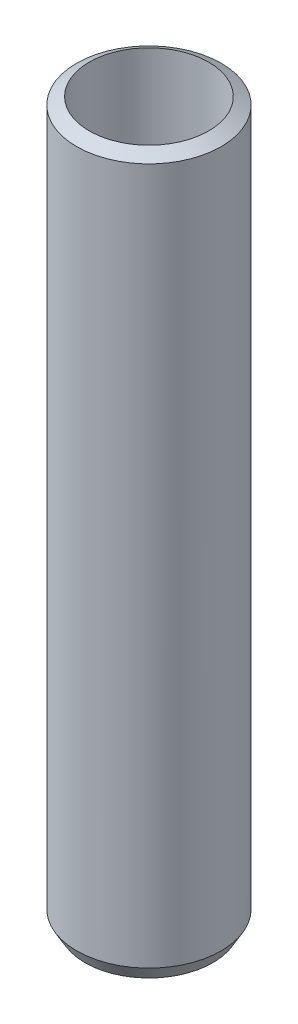
ISO-10303-21;
HEADER;
FILE_DESCRIPTION(('STEP AP214'),'2;1');
FILE_NAME('part.step','',(''),(''),'','','');
FILE_SCHEMA(('AUTOMOTIVE_DESIGN { 1 0 10303 214 1 1 1 1 }'));
ENDSEC;
DATA;
#1=APPLICATION_CONTEXT('core data for automotive mechanical design processes');
#2=APPLICATION_PROTOCOL_DEFINITION('international standard','automotive_design',2000,#1);
#3=PRODUCT_CONTEXT('',#1,'mechanical');
#4=PRODUCT('Part','Part','',(#3));
#5=PRODUCT_RELATED_PRODUCT_CATEGORY('part','',(#4));
#6=PRODUCT_DEFINITION_FORMATION('','',#4);
#7=PRODUCT_DEFINITION_CONTEXT('part definition',#1,'design');
#8=PRODUCT_DEFINITION('design','',#6,#7);
#9=PRODUCT_DEFINITION_SHAPE('','',#8);
#10=(LENGTH_UNIT() NAMED_UNIT(*) SI_UNIT(.MILLI.,.METRE.));
#11=(NAMED_UNIT(*) PLANE_ANGLE_UNIT() SI_UNIT($,.RADIAN.));
#12=(NAMED_UNIT(*) SI_UNIT($,.STERADIAN.) SOLID_ANGLE_UNIT());
#13=UNCERTAINTY_MEASURE_WITH_UNIT(LENGTH_MEASURE(1.E-05),#10,'distance_accuracy_value','');
#14=(GEOMETRIC_REPRESENTATION_CONTEXT(3) GLOBAL_UNCERTAINTY_ASSIGNED_CONTEXT((#13)) GLOBAL_UNIT_ASSIGNED_CONTEXT((#10,
#11,#12)) REPRESENTATION_CONTEXT('',''));
#15=CARTESIAN_POINT('',(0.,0.,0.));
#16=DIRECTION('',(0.,0.,1.));
#17=DIRECTION('',(1.,0.,0.));
#18=AXIS2_PLACEMENT_3D('',#15,#16,#17);
#19=CARTESIAN_POINT('',(0.,398.088562221238,0.));
#20=DIRECTION('',(0.,-1.,0.));
#21=DIRECTION('',(0.,0.,-1.));
#22=AXIS2_PLACEMENT_3D('',#19,#20,#21);
#23=CYLINDRICAL_SURFACE('',#22,40.);
#24=CARTESIAN_POINT('',(0.,393.462672284806,0.));
#25=DIRECTION('',(0.,1.,0.));
#26=DIRECTION('',(0.,0.,1.));
#27=AXIS2_PLACEMENT_3D('',#24,#25,#26);
#28=CIRCLE('',#27,40.);
#29=CARTESIAN_POINT('',(0.,393.462672284806,40.));
#30=VERTEX_POINT('',#29);
#31=EDGE_CURVE('E50',#30,#30,#28,.F.);
#32=ORIENTED_EDGE('',*,*,#31,.T.);
#33=EDGE_LOOP('',(#32));
#34=FACE_BOUND('',#33,.T.);
#35=CARTESIAN_POINT('',(0.,8.01227640012126,0.));
#36=DIRECTION('',(0.,1.,0.));
#37=DIRECTION('',(0.,0.,1.));
#38=AXIS2_PLACEMENT_3D('',#35,#36,#37);
#39=CIRCLE('',#38,40.);
#40=CARTESIAN_POINT('',(0.,8.01227640012126,40.));
#41=VERTEX_POINT('',#40);
#42=EDGE_CURVE('E51',#41,#41,#39,.T.);
#43=ORIENTED_EDGE('',*,*,#42,.T.);
#44=EDGE_LOOP('',(#43));
#45=FACE_BOUND('',#44,.T.);
#46=ADVANCED_FACE('F39',(#34,#45),#23,.T.);
#47=CARTESIAN_POINT('',(0.,0.,0.));
#48=DIRECTION('',(0.,1.,0.));
#49=DIRECTION('',(0.,0.,1.));
#50=AXIS2_PLACEMENT_3D('',#47,#48,#49);
#51=PLANE('',#50);
#52=CARTESIAN_POINT('',(0.,0.,0.));
#53=DIRECTION('',(0.,1.,0.));
#54=DIRECTION('',(0.,0.,1.));
#55=AXIS2_PLACEMENT_3D('',#52,#53,#54);
#56=CIRCLE('',#55,35.3741100635682);
#57=CARTESIAN_POINT('',(0.,0.,35.3741100635682));
#58=VERTEX_POINT('',#57);
#59=EDGE_CURVE('E10',#58,#58,#56,.F.);
#60=ORIENTED_EDGE('',*,*,#59,.T.);
#61=EDGE_LOOP('',(#60));
#62=FACE_BOUND('',#61,.T.);
#63=CARTESIAN_POINT('',(0.,0.,0.));
#64=DIRECTION('',(0.,1.,0.));
#65=DIRECTION('',(0.,0.,1.));
#66=AXIS2_PLACEMENT_3D('',#63,#64,#65);
#67=CIRCLE('',#66,33.0331764672547);
#68=CARTESIAN_POINT('',(0.,0.,33.0331764672547));
#69=VERTEX_POINT('',#68);
#70=EDGE_CURVE('E58',#69,#69,#67,.T.);
#71=ORIENTED_EDGE('',*,*,#70,.T.);
#72=EDGE_LOOP('',(#71));
#73=FACE_BOUND('',#72,.T.);
#74=ADVANCED_FACE('F62',(#62,#73),#51,.F.);
#75=CARTESIAN_POINT('',(0.,398.088562221238,0.));
#76=DIRECTION('',(0.,-1.,0.));
#77=DIRECTION('',(0.,0.,-1.));
#78=AXIS2_PLACEMENT_3D('',#75,#76,#77);
#79=CYLINDRICAL_SURFACE('',#78,33.0331764672547);
#80=CARTESIAN_POINT('',(0.,397.484969726833,0.));
#81=DIRECTION('',(0.,-1.,0.));
#82=DIRECTION('',(0.,0.,-1.));
#83=AXIS2_PLACEMENT_3D('',#80,#81,#82);
#84=CIRCLE('',#83,33.0331764672547);
#85=CARTESIAN_POINT('',(0.,397.484969726833,-33.0331764672547));
#86=VERTEX_POINT('',#85);
#87=EDGE_CURVE('E54',#86,#86,#84,.F.);
#88=ORIENTED_EDGE('',*,*,#87,.T.);
#89=EDGE_LOOP('',(#88));
#90=FACE_BOUND('',#89,.T.);
#91=ORIENTED_EDGE('',*,*,#70,.F.);
#92=EDGE_LOOP('',(#91));
#93=FACE_BOUND('',#92,.T.);
#94=ADVANCED_FACE('F68',(#90,#93),#79,.F.);
#95=CARTESIAN_POINT('',(0.,398.088562221238,0.));
#96=DIRECTION('',(0.,-1.,0.));
#97=DIRECTION('',(0.,0.,-1.));
#98=AXIS2_PLACEMENT_3D('',#95,#96,#97);
#99=CONICAL_SURFACE('',#98,31.9877235998785,1.0471975511966);
#100=ORIENTED_EDGE('',*,*,#31,.F.);
#101=EDGE_LOOP('',(#100));
#102=FACE_BOUND('',#101,.T.);
#103=ORIENTED_EDGE('',*,*,#87,.F.);
#104=EDGE_LOOP('',(#103));
#105=FACE_BOUND('',#104,.T.);
#106=ADVANCED_FACE('F66',(#102,#105),#99,.T.);
#107=CARTESIAN_POINT('',(0.,8.01227640012126,0.));
#108=DIRECTION('',(0.,1.,0.));
#109=DIRECTION('',(0.,0.,1.));
#110=AXIS2_PLACEMENT_3D('',#107,#108,#109);
#111=CONICAL_SURFACE('',#110,40.,0.523598775598305);
#112=ORIENTED_EDGE('',*,*,#59,.F.);
#113=EDGE_LOOP('',(#112));
#114=FACE_BOUND('',#113,.T.);
#115=ORIENTED_EDGE('',*,*,#42,.F.);
#116=EDGE_LOOP('',(#115));
#117=FACE_BOUND('',#116,.T.);
#118=ADVANCED_FACE('F45',(#114,#117),#111,.T.);
#119=CLOSED_SHELL('',(#46,#74,#94,#106,#118));
#120=MANIFOLD_SOLID_BREP('B2',#119);
#121=ADVANCED_BREP_SHAPE_REPRESENTATION('',(#18,#120),#14);
#122=SHAPE_DEFINITION_REPRESENTATION(#9,#121);
ENDSEC;
END-ISO-10303-21;
